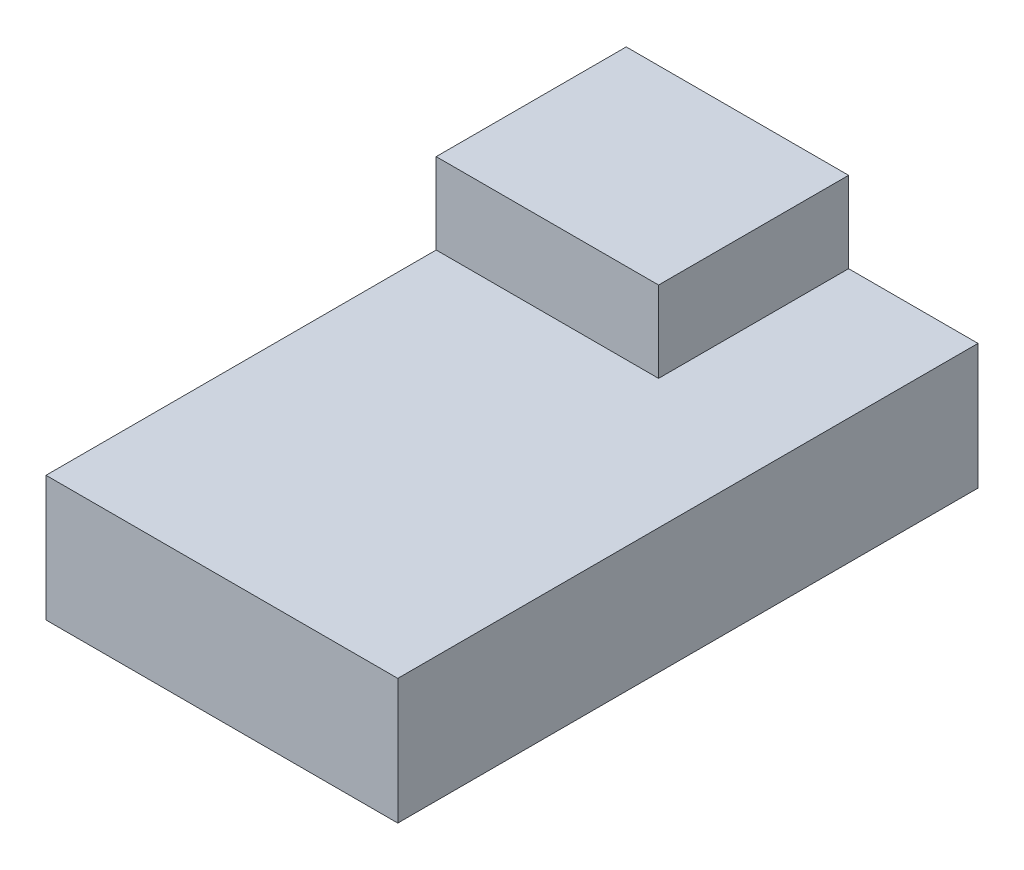
ISO-10303-21;
HEADER;
FILE_DESCRIPTION(('STEP AP214'),'2;1');
FILE_NAME('part.step','',(''),(''),'','','');
FILE_SCHEMA(('AUTOMOTIVE_DESIGN { 1 0 10303 214 1 1 1 1 }'));
ENDSEC;
DATA;
#1=APPLICATION_CONTEXT('core data for automotive mechanical design processes');
#2=APPLICATION_PROTOCOL_DEFINITION('international standard','automotive_design',2000,#1);
#3=PRODUCT_CONTEXT('',#1,'mechanical');
#4=PRODUCT('Part','Part','',(#3));
#5=PRODUCT_RELATED_PRODUCT_CATEGORY('part','',(#4));
#6=PRODUCT_DEFINITION_FORMATION('','',#4);
#7=PRODUCT_DEFINITION_CONTEXT('part definition',#1,'design');
#8=PRODUCT_DEFINITION('design','',#6,#7);
#9=PRODUCT_DEFINITION_SHAPE('','',#8);
#10=(LENGTH_UNIT() NAMED_UNIT(*) SI_UNIT(.MILLI.,.METRE.));
#11=(NAMED_UNIT(*) PLANE_ANGLE_UNIT() SI_UNIT($,.RADIAN.));
#12=(NAMED_UNIT(*) SI_UNIT($,.STERADIAN.) SOLID_ANGLE_UNIT());
#13=UNCERTAINTY_MEASURE_WITH_UNIT(LENGTH_MEASURE(1.E-05),#10,'distance_accuracy_value','');
#14=(GEOMETRIC_REPRESENTATION_CONTEXT(3) GLOBAL_UNCERTAINTY_ASSIGNED_CONTEXT((#13)) GLOBAL_UNIT_ASSIGNED_CONTEXT((#10,
#11,#12)) REPRESENTATION_CONTEXT('',''));
#15=CARTESIAN_POINT('',(0.,0.,0.));
#16=DIRECTION('',(0.,0.,1.));
#17=DIRECTION('',(1.,0.,0.));
#18=AXIS2_PLACEMENT_3D('',#15,#16,#17);
#19=CARTESIAN_POINT('',(-11.049,7.874,18.224376448245));
#20=DIRECTION('',(1.,0.,0.));
#21=DIRECTION('',(0.,0.,-1.));
#22=AXIS2_PLACEMENT_3D('',#19,#20,#21);
#23=PLANE('',#22);
#24=DIRECTION('',(0.,0.,1.));
#25=VECTOR('',#24,1.);
#26=CARTESIAN_POINT('',(-11.049,0.,18.224376448245));
#27=LINE('',#26,#25);
#28=CARTESIAN_POINT('',(-11.049,0.,-18.224376448245));
#29=VERTEX_POINT('',#28);
#30=CARTESIAN_POINT('',(-11.049,0.,18.224376448245));
#31=VERTEX_POINT('',#30);
#32=EDGE_CURVE('E114',#29,#31,#27,.T.);
#33=ORIENTED_EDGE('',*,*,#32,.T.);
#34=DIRECTION('',(0.,-1.,0.));
#35=VECTOR('',#34,1.);
#36=CARTESIAN_POINT('',(-11.049,7.874,18.224376448245));
#37=LINE('',#36,#35);
#38=CARTESIAN_POINT('',(-11.049,7.874,18.224376448245));
#39=VERTEX_POINT('',#38);
#40=EDGE_CURVE('E11',#39,#31,#37,.T.);
#41=ORIENTED_EDGE('',*,*,#40,.F.);
#42=DIRECTION('',(0.,0.,1.));
#43=VECTOR('',#42,1.);
#44=CARTESIAN_POINT('',(-11.049,7.874,18.224376448245));
#45=LINE('',#44,#43);
#46=CARTESIAN_POINT('',(-11.049,7.874,-6.28637644824504));
#47=VERTEX_POINT('',#46);
#48=EDGE_CURVE('E113',#47,#39,#45,.T.);
#49=ORIENTED_EDGE('',*,*,#48,.F.);
#50=DIRECTION('',(0.,-1.,0.));
#51=VECTOR('',#50,1.);
#52=CARTESIAN_POINT('',(-11.049,12.954,-6.28637644824504));
#53=LINE('',#52,#51);
#54=CARTESIAN_POINT('',(-11.049,12.954,-6.28637644824504));
#55=VERTEX_POINT('',#54);
#56=EDGE_CURVE('E94',#55,#47,#53,.T.);
#57=ORIENTED_EDGE('',*,*,#56,.F.);
#58=DIRECTION('',(0.,0.,1.));
#59=VECTOR('',#58,1.);
#60=CARTESIAN_POINT('',(-11.049,12.954,-18.224376448245));
#61=LINE('',#60,#59);
#62=CARTESIAN_POINT('',(-11.049,12.954,-18.224376448245));
#63=VERTEX_POINT('',#62);
#64=EDGE_CURVE('E100',#63,#55,#61,.T.);
#65=ORIENTED_EDGE('',*,*,#64,.F.);
#66=DIRECTION('',(0.,-1.,0.));
#67=VECTOR('',#66,1.);
#68=CARTESIAN_POINT('',(-11.049,7.874,-18.224376448245));
#69=LINE('',#68,#67);
#70=EDGE_CURVE('E140',#63,#29,#69,.T.);
#71=ORIENTED_EDGE('',*,*,#70,.T.);
#72=EDGE_LOOP('',(#33,#41,#49,#57,#65,#71));
#73=FACE_BOUND('',#72,.T.);
#74=ADVANCED_FACE('F31',(#73),#23,.F.);
#75=CARTESIAN_POINT('',(11.049,7.874,18.224376448245));
#76=DIRECTION('',(0.,0.,-1.));
#77=DIRECTION('',(-1.,0.,0.));
#78=AXIS2_PLACEMENT_3D('',#75,#76,#77);
#79=PLANE('',#78);
#80=DIRECTION('',(1.,0.,0.));
#81=VECTOR('',#80,1.);
#82=CARTESIAN_POINT('',(11.049,0.,18.224376448245));
#83=LINE('',#82,#81);
#84=CARTESIAN_POINT('',(11.049,0.,18.224376448245));
#85=VERTEX_POINT('',#84);
#86=EDGE_CURVE('E116',#31,#85,#83,.T.);
#87=ORIENTED_EDGE('',*,*,#86,.T.);
#88=DIRECTION('',(0.,-1.,0.));
#89=VECTOR('',#88,1.);
#90=CARTESIAN_POINT('',(11.049,7.874,18.224376448245));
#91=LINE('',#90,#89);
#92=CARTESIAN_POINT('',(11.049,7.874,18.224376448245));
#93=VERTEX_POINT('',#92);
#94=EDGE_CURVE('E39',#93,#85,#91,.T.);
#95=ORIENTED_EDGE('',*,*,#94,.F.);
#96=DIRECTION('',(1.,0.,0.));
#97=VECTOR('',#96,1.);
#98=CARTESIAN_POINT('',(11.049,7.874,18.224376448245));
#99=LINE('',#98,#97);
#100=EDGE_CURVE('E133',#39,#93,#99,.T.);
#101=ORIENTED_EDGE('',*,*,#100,.F.);
#102=ORIENTED_EDGE('',*,*,#40,.T.);
#103=EDGE_LOOP('',(#87,#95,#101,#102));
#104=FACE_BOUND('',#103,.T.);
#105=ADVANCED_FACE('F166',(#104),#79,.F.);
#106=CARTESIAN_POINT('',(11.049,7.874,18.224376448245));
#107=DIRECTION('',(-1.,0.,0.));
#108=DIRECTION('',(0.,0.,1.));
#109=AXIS2_PLACEMENT_3D('',#106,#107,#108);
#110=PLANE('',#109);
#111=DIRECTION('',(0.,0.,-1.));
#112=VECTOR('',#111,1.);
#113=CARTESIAN_POINT('',(11.049,0.,18.224376448245));
#114=LINE('',#113,#112);
#115=CARTESIAN_POINT('',(11.049,0.,-18.224376448245));
#116=VERTEX_POINT('',#115);
#117=EDGE_CURVE('E145',#85,#116,#114,.T.);
#118=ORIENTED_EDGE('',*,*,#117,.T.);
#119=DIRECTION('',(0.,-1.,0.));
#120=VECTOR('',#119,1.);
#121=CARTESIAN_POINT('',(11.049,7.874,-18.224376448245));
#122=LINE('',#121,#120);
#123=CARTESIAN_POINT('',(11.049,7.874,-18.224376448245));
#124=VERTEX_POINT('',#123);
#125=EDGE_CURVE('E149',#124,#116,#122,.T.);
#126=ORIENTED_EDGE('',*,*,#125,.F.);
#127=DIRECTION('',(0.,0.,-1.));
#128=VECTOR('',#127,1.);
#129=CARTESIAN_POINT('',(11.049,7.874,18.224376448245));
#130=LINE('',#129,#128);
#131=EDGE_CURVE('E141',#93,#124,#130,.T.);
#132=ORIENTED_EDGE('',*,*,#131,.F.);
#133=ORIENTED_EDGE('',*,*,#94,.T.);
#134=EDGE_LOOP('',(#118,#126,#132,#133));
#135=FACE_BOUND('',#134,.T.);
#136=ADVANCED_FACE('F156',(#135),#110,.F.);
#137=CARTESIAN_POINT('',(11.049,7.874,-18.224376448245));
#138=DIRECTION('',(0.,0.,1.));
#139=DIRECTION('',(1.,0.,0.));
#140=AXIS2_PLACEMENT_3D('',#137,#138,#139);
#141=PLANE('',#140);
#142=DIRECTION('',(-1.,0.,0.));
#143=VECTOR('',#142,1.);
#144=CARTESIAN_POINT('',(11.049,0.,-18.224376448245));
#145=LINE('',#144,#143);
#146=EDGE_CURVE('E137',#116,#29,#145,.T.);
#147=ORIENTED_EDGE('',*,*,#146,.T.);
#148=ORIENTED_EDGE('',*,*,#70,.F.);
#149=DIRECTION('',(-1.,0.,0.));
#150=VECTOR('',#149,1.);
#151=CARTESIAN_POINT('',(-11.049,12.954,-18.224376448245));
#152=LINE('',#151,#150);
#153=CARTESIAN_POINT('',(2.921,12.954,-18.224376448245));
#154=VERTEX_POINT('',#153);
#155=EDGE_CURVE('E106',#154,#63,#152,.T.);
#156=ORIENTED_EDGE('',*,*,#155,.F.);
#157=DIRECTION('',(0.,-1.,0.));
#158=VECTOR('',#157,1.);
#159=CARTESIAN_POINT('',(2.921,12.954,-18.224376448245));
#160=LINE('',#159,#158);
#161=CARTESIAN_POINT('',(2.921,7.874,-18.224376448245));
#162=VERTEX_POINT('',#161);
#163=EDGE_CURVE('E118',#154,#162,#160,.T.);
#164=ORIENTED_EDGE('',*,*,#163,.T.);
#165=DIRECTION('',(-1.,0.,0.));
#166=VECTOR('',#165,1.);
#167=CARTESIAN_POINT('',(11.049,7.874,-18.224376448245));
#168=LINE('',#167,#166);
#169=EDGE_CURVE('E47',#124,#162,#168,.T.);
#170=ORIENTED_EDGE('',*,*,#169,.F.);
#171=ORIENTED_EDGE('',*,*,#125,.T.);
#172=EDGE_LOOP('',(#147,#148,#156,#164,#170,#171));
#173=FACE_BOUND('',#172,.T.);
#174=ADVANCED_FACE('F165',(#173),#141,.F.);
#175=CARTESIAN_POINT('',(-11.049,7.874,-18.224376448245));
#176=DIRECTION('',(0.,1.,0.));
#177=DIRECTION('',(0.,0.,1.));
#178=AXIS2_PLACEMENT_3D('',#175,#176,#177);
#179=PLANE('',#178);
#180=DIRECTION('',(0.,0.,-1.));
#181=VECTOR('',#180,1.);
#182=CARTESIAN_POINT('',(2.921,7.874,-18.224376448245));
#183=LINE('',#182,#181);
#184=CARTESIAN_POINT('',(2.921,7.874,-6.28637644824504));
#185=VERTEX_POINT('',#184);
#186=EDGE_CURVE('E109',#185,#162,#183,.T.);
#187=ORIENTED_EDGE('',*,*,#186,.F.);
#188=DIRECTION('',(1.,0.,0.));
#189=VECTOR('',#188,1.);
#190=CARTESIAN_POINT('',(-11.049,7.874,-6.28637644824504));
#191=LINE('',#190,#189);
#192=EDGE_CURVE('E53',#47,#185,#191,.T.);
#193=ORIENTED_EDGE('',*,*,#192,.F.);
#194=ORIENTED_EDGE('',*,*,#48,.T.);
#195=ORIENTED_EDGE('',*,*,#100,.T.);
#196=ORIENTED_EDGE('',*,*,#131,.T.);
#197=ORIENTED_EDGE('',*,*,#169,.T.);
#198=EDGE_LOOP('',(#187,#193,#194,#195,#196,#197));
#199=FACE_BOUND('',#198,.T.);
#200=ADVANCED_FACE('F167',(#199),#179,.T.);
#201=CARTESIAN_POINT('',(-11.049,0.,-18.224376448245));
#202=DIRECTION('',(0.,1.,0.));
#203=DIRECTION('',(0.,0.,1.));
#204=AXIS2_PLACEMENT_3D('',#201,#202,#203);
#205=PLANE('',#204);
#206=ORIENTED_EDGE('',*,*,#32,.F.);
#207=ORIENTED_EDGE('',*,*,#146,.F.);
#208=ORIENTED_EDGE('',*,*,#117,.F.);
#209=ORIENTED_EDGE('',*,*,#86,.F.);
#210=EDGE_LOOP('',(#206,#207,#208,#209));
#211=FACE_BOUND('',#210,.T.);
#212=ADVANCED_FACE('F163',(#211),#205,.F.);
#213=CARTESIAN_POINT('',(-11.049,12.954,-6.28637644824504));
#214=DIRECTION('',(0.,0.,-1.));
#215=DIRECTION('',(-1.,0.,0.));
#216=AXIS2_PLACEMENT_3D('',#213,#214,#215);
#217=PLANE('',#216);
#218=ORIENTED_EDGE('',*,*,#192,.T.);
#219=DIRECTION('',(0.,-1.,0.));
#220=VECTOR('',#219,1.);
#221=CARTESIAN_POINT('',(2.921,12.954,-6.28637644824504));
#222=LINE('',#221,#220);
#223=CARTESIAN_POINT('',(2.921,12.954,-6.28637644824504));
#224=VERTEX_POINT('',#223);
#225=EDGE_CURVE('E96',#224,#185,#222,.T.);
#226=ORIENTED_EDGE('',*,*,#225,.F.);
#227=DIRECTION('',(1.,0.,0.));
#228=VECTOR('',#227,1.);
#229=CARTESIAN_POINT('',(-11.049,12.954,-6.28637644824504));
#230=LINE('',#229,#228);
#231=EDGE_CURVE('E90',#55,#224,#230,.T.);
#232=ORIENTED_EDGE('',*,*,#231,.F.);
#233=ORIENTED_EDGE('',*,*,#56,.T.);
#234=EDGE_LOOP('',(#218,#226,#232,#233));
#235=FACE_BOUND('',#234,.T.);
#236=ADVANCED_FACE('F92',(#235),#217,.F.);
#237=CARTESIAN_POINT('',(2.921,12.954,-18.224376448245));
#238=DIRECTION('',(-1.,0.,0.));
#239=DIRECTION('',(0.,0.,1.));
#240=AXIS2_PLACEMENT_3D('',#237,#238,#239);
#241=PLANE('',#240);
#242=ORIENTED_EDGE('',*,*,#186,.T.);
#243=ORIENTED_EDGE('',*,*,#163,.F.);
#244=DIRECTION('',(0.,0.,-1.));
#245=VECTOR('',#244,1.);
#246=CARTESIAN_POINT('',(2.921,12.954,-18.224376448245));
#247=LINE('',#246,#245);
#248=EDGE_CURVE('E99',#224,#154,#247,.T.);
#249=ORIENTED_EDGE('',*,*,#248,.F.);
#250=ORIENTED_EDGE('',*,*,#225,.T.);
#251=EDGE_LOOP('',(#242,#243,#249,#250));
#252=FACE_BOUND('',#251,.T.);
#253=ADVANCED_FACE('F171',(#252),#241,.F.);
#254=CARTESIAN_POINT('',(-11.049,12.954,-6.28637644824504));
#255=DIRECTION('',(0.,1.,0.));
#256=DIRECTION('',(0.,0.,1.));
#257=AXIS2_PLACEMENT_3D('',#254,#255,#256);
#258=PLANE('',#257);
#259=ORIENTED_EDGE('',*,*,#64,.T.);
#260=ORIENTED_EDGE('',*,*,#231,.T.);
#261=ORIENTED_EDGE('',*,*,#248,.T.);
#262=ORIENTED_EDGE('',*,*,#155,.T.);
#263=EDGE_LOOP('',(#259,#260,#261,#262));
#264=FACE_BOUND('',#263,.T.);
#265=ADVANCED_FACE('F104',(#264),#258,.T.);
#266=CLOSED_SHELL('',(#74,#105,#136,#174,#200,#212,#236,#253,#265));
#267=MANIFOLD_SOLID_BREP('B2',#266);
#268=ADVANCED_BREP_SHAPE_REPRESENTATION('',(#18,#267),#14);
#269=SHAPE_DEFINITION_REPRESENTATION(#9,#268);
ENDSEC;
END-ISO-10303-21;
